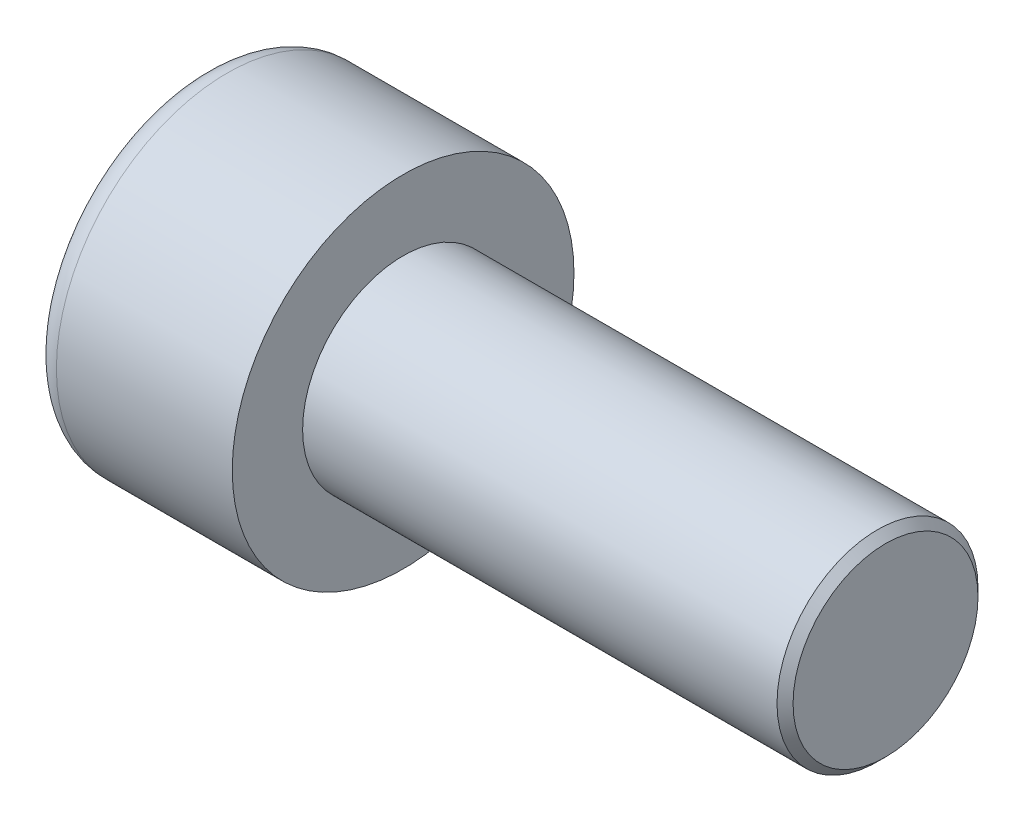
ISO-10303-21;
HEADER;
FILE_DESCRIPTION(('STEP AP214'),'2;1');
FILE_NAME('part.step','',(''),(''),'','','');
FILE_SCHEMA(('AUTOMOTIVE_DESIGN { 1 0 10303 214 1 1 1 1 }'));
ENDSEC;
DATA;
#1=APPLICATION_CONTEXT('core data for automotive mechanical design processes');
#2=APPLICATION_PROTOCOL_DEFINITION('international standard','automotive_design',2000,#1);
#3=PRODUCT_CONTEXT('',#1,'mechanical');
#4=PRODUCT('Part','Part','',(#3));
#5=PRODUCT_RELATED_PRODUCT_CATEGORY('part','',(#4));
#6=PRODUCT_DEFINITION_FORMATION('','',#4);
#7=PRODUCT_DEFINITION_CONTEXT('part definition',#1,'design');
#8=PRODUCT_DEFINITION('design','',#6,#7);
#9=PRODUCT_DEFINITION_SHAPE('','',#8);
#10=(LENGTH_UNIT() NAMED_UNIT(*) SI_UNIT(.MILLI.,.METRE.));
#11=(NAMED_UNIT(*) PLANE_ANGLE_UNIT() SI_UNIT($,.RADIAN.));
#12=(NAMED_UNIT(*) SI_UNIT($,.STERADIAN.) SOLID_ANGLE_UNIT());
#13=UNCERTAINTY_MEASURE_WITH_UNIT(LENGTH_MEASURE(1.E-05),#10,'distance_accuracy_value','');
#14=(GEOMETRIC_REPRESENTATION_CONTEXT(3) GLOBAL_UNCERTAINTY_ASSIGNED_CONTEXT((#13)) GLOBAL_UNIT_ASSIGNED_CONTEXT((#10,
#11,#12)) REPRESENTATION_CONTEXT('',''));
#15=CARTESIAN_POINT('',(0.,0.,0.));
#16=DIRECTION('',(0.,0.,1.));
#17=DIRECTION('',(1.,0.,0.));
#18=AXIS2_PLACEMENT_3D('',#15,#16,#17);
#19=CARTESIAN_POINT('',(2.5,0.,-2.3094010767585));
#20=DIRECTION('',(1.,0.,0.));
#21=DIRECTION('',(0.,0.,-1.));
#22=AXIS2_PLACEMENT_3D('',#19,#20,#21);
#23=PLANE('',#22);
#24=CARTESIAN_POINT('',(2.5,0.,0.));
#25=DIRECTION('',(1.,0.,0.));
#26=DIRECTION('',(0.,0.,-1.));
#27=AXIS2_PLACEMENT_3D('',#24,#25,#26);
#28=CIRCLE('',#27,2.);
#29=CARTESIAN_POINT('',(2.5,-1.,-1.73205080756888));
#30=VERTEX_POINT('',#29);
#31=CARTESIAN_POINT('',(2.5,-2.,0.));
#32=VERTEX_POINT('',#31);
#33=EDGE_CURVE('E160',#30,#32,#28,.F.);
#34=ORIENTED_EDGE('',*,*,#33,.F.);
#35=DIRECTION('',(0.,0.866025403784439,-0.5));
#36=VECTOR('',#35,1.);
#37=CARTESIAN_POINT('',(2.5,-2.,-1.15470053837925));
#38=LINE('',#37,#36);
#39=CARTESIAN_POINT('',(2.5,-2.,-1.15470053837925));
#40=VERTEX_POINT('',#39);
#41=EDGE_CURVE('E168',#40,#30,#38,.T.);
#42=ORIENTED_EDGE('',*,*,#41,.F.);
#43=DIRECTION('',(0.,0.,-1.));
#44=VECTOR('',#43,1.);
#45=CARTESIAN_POINT('',(2.5,-2.,1.15470053837925));
#46=LINE('',#45,#44);
#47=EDGE_CURVE('E185',#32,#40,#46,.T.);
#48=ORIENTED_EDGE('',*,*,#47,.F.);
#49=EDGE_LOOP('',(#34,#42,#48));
#50=FACE_BOUND('',#49,.T.);
#51=ADVANCED_FACE('F37',(#50),#23,.F.);
#52=CARTESIAN_POINT('',(2.5,-1.,1.73205080756888));
#53=VERTEX_POINT('',#52);
#54=EDGE_CURVE('E290',#32,#53,#28,.F.);
#55=ORIENTED_EDGE('',*,*,#54,.F.);
#56=CARTESIAN_POINT('',(2.5,-2.,1.15470053837925));
#57=VERTEX_POINT('',#56);
#58=EDGE_CURVE('E186',#57,#32,#46,.T.);
#59=ORIENTED_EDGE('',*,*,#58,.F.);
#60=DIRECTION('',(0.,-0.866025403784439,-0.5));
#61=VECTOR('',#60,1.);
#62=CARTESIAN_POINT('',(2.5,0.,2.3094010767585));
#63=LINE('',#62,#61);
#64=EDGE_CURVE('E181',#53,#57,#63,.T.);
#65=ORIENTED_EDGE('',*,*,#64,.F.);
#66=EDGE_LOOP('',(#55,#59,#65));
#67=FACE_BOUND('',#66,.T.);
#68=ADVANCED_FACE('F126',(#67),#23,.F.);
#69=CARTESIAN_POINT('',(2.5,1.,1.73205080756888));
#70=VERTEX_POINT('',#69);
#71=EDGE_CURVE('E286',#53,#70,#28,.F.);
#72=ORIENTED_EDGE('',*,*,#71,.F.);
#73=CARTESIAN_POINT('',(2.5,0.,2.3094010767585));
#74=VERTEX_POINT('',#73);
#75=EDGE_CURVE('E182',#74,#53,#63,.T.);
#76=ORIENTED_EDGE('',*,*,#75,.F.);
#77=DIRECTION('',(0.,-0.866025403784438,0.5));
#78=VECTOR('',#77,1.);
#79=CARTESIAN_POINT('',(2.5,2.,1.15470053837925));
#80=LINE('',#79,#78);
#81=EDGE_CURVE('E177',#70,#74,#80,.T.);
#82=ORIENTED_EDGE('',*,*,#81,.F.);
#83=EDGE_LOOP('',(#72,#76,#82));
#84=FACE_BOUND('',#83,.T.);
#85=ADVANCED_FACE('F132',(#84),#23,.F.);
#86=CARTESIAN_POINT('',(2.5,2.,0.));
#87=VERTEX_POINT('',#86);
#88=EDGE_CURVE('E157',#70,#87,#28,.F.);
#89=ORIENTED_EDGE('',*,*,#88,.F.);
#90=CARTESIAN_POINT('',(2.5,2.,1.15470053837925));
#91=VERTEX_POINT('',#90);
#92=EDGE_CURVE('E178',#91,#70,#80,.T.);
#93=ORIENTED_EDGE('',*,*,#92,.F.);
#94=DIRECTION('',(0.,0.,1.));
#95=VECTOR('',#94,1.);
#96=CARTESIAN_POINT('',(2.5,2.,-1.15470053837925));
#97=LINE('',#96,#95);
#98=EDGE_CURVE('E172',#87,#91,#97,.T.);
#99=ORIENTED_EDGE('',*,*,#98,.F.);
#100=EDGE_LOOP('',(#89,#93,#99));
#101=FACE_BOUND('',#100,.T.);
#102=ADVANCED_FACE('F146',(#101),#23,.F.);
#103=CARTESIAN_POINT('',(2.5,0.,0.));
#104=DIRECTION('',(1.,0.,0.));
#105=DIRECTION('',(0.,0.,-1.));
#106=AXIS2_PLACEMENT_3D('',#103,#104,#105);
#107=CIRCLE('',#106,2.);
#108=CARTESIAN_POINT('',(2.5,1.,-1.73205080756888));
#109=VERTEX_POINT('',#108);
#110=EDGE_CURVE('E52',#109,#87,#107,.T.);
#111=ORIENTED_EDGE('',*,*,#110,.T.);
#112=CARTESIAN_POINT('',(2.5,2.,-1.15470053837925));
#113=VERTEX_POINT('',#112);
#114=EDGE_CURVE('E165',#113,#87,#97,.T.);
#115=ORIENTED_EDGE('',*,*,#114,.F.);
#116=DIRECTION('',(0.,0.866025403784438,0.5));
#117=VECTOR('',#116,1.);
#118=CARTESIAN_POINT('',(2.5,0.,-2.3094010767585));
#119=LINE('',#118,#117);
#120=EDGE_CURVE('E162',#109,#113,#119,.T.);
#121=ORIENTED_EDGE('',*,*,#120,.F.);
#122=EDGE_LOOP('',(#111,#115,#121));
#123=FACE_BOUND('',#122,.T.);
#124=ADVANCED_FACE('F137',(#123),#23,.F.);
#125=EDGE_CURVE('E150',#109,#30,#28,.F.);
#126=ORIENTED_EDGE('',*,*,#125,.F.);
#127=CARTESIAN_POINT('',(2.5,0.,-2.3094010767585));
#128=VERTEX_POINT('',#127);
#129=EDGE_CURVE('E153',#128,#109,#119,.T.);
#130=ORIENTED_EDGE('',*,*,#129,.F.);
#131=EDGE_CURVE('E155',#30,#128,#38,.T.);
#132=ORIENTED_EDGE('',*,*,#131,.F.);
#133=EDGE_LOOP('',(#126,#130,#132));
#134=FACE_BOUND('',#133,.T.);
#135=ADVANCED_FACE('F128',(#134),#23,.F.);
#136=CARTESIAN_POINT('',(0.,0.,0.));
#137=DIRECTION('',(1.,0.,0.));
#138=DIRECTION('',(0.,0.,-1.));
#139=AXIS2_PLACEMENT_3D('',#136,#137,#138);
#140=PLANE('',#139);
#141=CARTESIAN_POINT('',(0.,0.,0.));
#142=DIRECTION('',(1.,0.,0.));
#143=DIRECTION('',(0.,0.,-1.));
#144=AXIS2_PLACEMENT_3D('',#141,#142,#143);
#145=CIRCLE('',#144,3.625);
#146=CARTESIAN_POINT('',(0.,0.,-3.625));
#147=VERTEX_POINT('',#146);
#148=EDGE_CURVE('E225',#147,#147,#145,.F.);
#149=ORIENTED_EDGE('',*,*,#148,.T.);
#150=EDGE_LOOP('',(#149));
#151=FACE_BOUND('',#150,.T.);
#152=DIRECTION('',(0.,0.866025403784439,-0.5));
#153=VECTOR('',#152,1.);
#154=CARTESIAN_POINT('',(0.,-2.,-1.15470053837925));
#155=LINE('',#154,#153);
#156=CARTESIAN_POINT('',(0.,-2.,-1.15470053837925));
#157=VERTEX_POINT('',#156);
#158=CARTESIAN_POINT('',(0.,0.,-2.3094010767585));
#159=VERTEX_POINT('',#158);
#160=EDGE_CURVE('E60',#157,#159,#155,.T.);
#161=ORIENTED_EDGE('',*,*,#160,.T.);
#162=DIRECTION('',(0.,0.866025403784438,0.5));
#163=VECTOR('',#162,1.);
#164=CARTESIAN_POINT('',(0.,0.,-2.3094010767585));
#165=LINE('',#164,#163);
#166=CARTESIAN_POINT('',(0.,2.,-1.15470053837925));
#167=VERTEX_POINT('',#166);
#168=EDGE_CURVE('E191',#159,#167,#165,.T.);
#169=ORIENTED_EDGE('',*,*,#168,.T.);
#170=DIRECTION('',(0.,0.,1.));
#171=VECTOR('',#170,1.);
#172=CARTESIAN_POINT('',(0.,2.,-1.15470053837925));
#173=LINE('',#172,#171);
#174=CARTESIAN_POINT('',(0.,2.,1.15470053837925));
#175=VERTEX_POINT('',#174);
#176=EDGE_CURVE('E194',#167,#175,#173,.T.);
#177=ORIENTED_EDGE('',*,*,#176,.T.);
#178=DIRECTION('',(0.,-0.866025403784438,0.5));
#179=VECTOR('',#178,1.);
#180=CARTESIAN_POINT('',(0.,2.,1.15470053837925));
#181=LINE('',#180,#179);
#182=CARTESIAN_POINT('',(0.,0.,2.3094010767585));
#183=VERTEX_POINT('',#182);
#184=EDGE_CURVE('E197',#175,#183,#181,.T.);
#185=ORIENTED_EDGE('',*,*,#184,.T.);
#186=DIRECTION('',(0.,-0.866025403784439,-0.5));
#187=VECTOR('',#186,1.);
#188=CARTESIAN_POINT('',(0.,0.,2.3094010767585));
#189=LINE('',#188,#187);
#190=CARTESIAN_POINT('',(0.,-2.,1.15470053837925));
#191=VERTEX_POINT('',#190);
#192=EDGE_CURVE('E200',#183,#191,#189,.T.);
#193=ORIENTED_EDGE('',*,*,#192,.T.);
#194=DIRECTION('',(0.,0.,-1.));
#195=VECTOR('',#194,1.);
#196=CARTESIAN_POINT('',(0.,-2.,1.15470053837925));
#197=LINE('',#196,#195);
#198=EDGE_CURVE('E203',#191,#157,#197,.T.);
#199=ORIENTED_EDGE('',*,*,#198,.T.);
#200=EDGE_LOOP('',(#161,#169,#177,#185,#193,#199));
#201=FACE_BOUND('',#200,.T.);
#202=ADVANCED_FACE('F136',(#151,#201),#140,.F.);
#203=CARTESIAN_POINT('',(5.,0.,0.));
#204=DIRECTION('',(1.,0.,0.));
#205=DIRECTION('',(0.,0.,-1.));
#206=AXIS2_PLACEMENT_3D('',#203,#204,#205);
#207=PLANE('',#206);
#208=CARTESIAN_POINT('',(5.,0.,0.));
#209=DIRECTION('',(1.,0.,0.));
#210=DIRECTION('',(0.,0.,-1.));
#211=AXIS2_PLACEMENT_3D('',#208,#209,#210);
#212=CIRCLE('',#211,4.25);
#213=CARTESIAN_POINT('',(5.,0.,-4.25));
#214=VERTEX_POINT('',#213);
#215=EDGE_CURVE('E158',#214,#214,#212,.T.);
#216=ORIENTED_EDGE('',*,*,#215,.T.);
#217=EDGE_LOOP('',(#216));
#218=FACE_BOUND('',#217,.T.);
#219=CARTESIAN_POINT('',(5.,0.,0.));
#220=DIRECTION('',(1.,0.,0.));
#221=DIRECTION('',(0.,0.,-1.));
#222=AXIS2_PLACEMENT_3D('',#219,#220,#221);
#223=CIRCLE('',#222,2.5);
#224=CARTESIAN_POINT('',(5.,0.,-2.5));
#225=VERTEX_POINT('',#224);
#226=EDGE_CURVE('E216',#225,#225,#223,.T.);
#227=ORIENTED_EDGE('',*,*,#226,.F.);
#228=EDGE_LOOP('',(#227));
#229=FACE_BOUND('',#228,.T.);
#230=ADVANCED_FACE('F143',(#218,#229),#207,.T.);
#231=CARTESIAN_POINT('',(5.,0.,0.));
#232=DIRECTION('',(-1.,0.,0.));
#233=DIRECTION('',(0.,0.,1.));
#234=AXIS2_PLACEMENT_3D('',#231,#232,#233);
#235=CYLINDRICAL_SURFACE('',#234,4.25);
#236=CARTESIAN_POINT('',(0.625,0.,0.));
#237=DIRECTION('',(1.,0.,0.));
#238=DIRECTION('',(0.,0.,-1.));
#239=AXIS2_PLACEMENT_3D('',#236,#237,#238);
#240=CIRCLE('',#239,4.25);
#241=CARTESIAN_POINT('',(0.625,0.,-4.25));
#242=VERTEX_POINT('',#241);
#243=EDGE_CURVE('E222',#242,#242,#240,.T.);
#244=ORIENTED_EDGE('',*,*,#243,.T.);
#245=EDGE_LOOP('',(#244));
#246=FACE_BOUND('',#245,.T.);
#247=ORIENTED_EDGE('',*,*,#215,.F.);
#248=EDGE_LOOP('',(#247));
#249=FACE_BOUND('',#248,.T.);
#250=ADVANCED_FACE('F241',(#246,#249),#235,.T.);
#251=CARTESIAN_POINT('',(17.,0.,0.));
#252=DIRECTION('',(-1.,0.,0.));
#253=DIRECTION('',(0.,0.,1.));
#254=AXIS2_PLACEMENT_3D('',#251,#252,#253);
#255=CYLINDRICAL_SURFACE('',#254,2.5);
#256=CARTESIAN_POINT('',(16.8,0.,0.));
#257=DIRECTION('',(1.,0.,0.));
#258=DIRECTION('',(0.,0.,-1.));
#259=AXIS2_PLACEMENT_3D('',#256,#257,#258);
#260=CIRCLE('',#259,2.5);
#261=CARTESIAN_POINT('',(16.8,0.,-2.5));
#262=VERTEX_POINT('',#261);
#263=EDGE_CURVE('E11',#262,#262,#260,.F.);
#264=ORIENTED_EDGE('',*,*,#263,.T.);
#265=EDGE_LOOP('',(#264));
#266=FACE_BOUND('',#265,.T.);
#267=ORIENTED_EDGE('',*,*,#226,.T.);
#268=EDGE_LOOP('',(#267));
#269=FACE_BOUND('',#268,.T.);
#270=ADVANCED_FACE('F238',(#266,#269),#255,.T.);
#271=CARTESIAN_POINT('',(17.,0.,0.));
#272=DIRECTION('',(1.,0.,0.));
#273=DIRECTION('',(0.,0.,-1.));
#274=AXIS2_PLACEMENT_3D('',#271,#272,#273);
#275=PLANE('',#274);
#276=CARTESIAN_POINT('',(17.,0.,0.));
#277=DIRECTION('',(1.,0.,0.));
#278=DIRECTION('',(0.,0.,-1.));
#279=AXIS2_PLACEMENT_3D('',#276,#277,#278);
#280=CIRCLE('',#279,2.3);
#281=CARTESIAN_POINT('',(17.,0.,-2.3));
#282=VERTEX_POINT('',#281);
#283=EDGE_CURVE('E45',#282,#282,#280,.T.);
#284=ORIENTED_EDGE('',*,*,#283,.T.);
#285=EDGE_LOOP('',(#284));
#286=FACE_BOUND('',#285,.T.);
#287=ADVANCED_FACE('F230',(#286),#275,.T.);
#288=CARTESIAN_POINT('',(2.5,-2.,-1.15470053837925));
#289=DIRECTION('',(0.,0.5,0.866025403784438));
#290=DIRECTION('',(0.,-0.866025403784439,0.5));
#291=AXIS2_PLACEMENT_3D('',#288,#289,#290);
#292=PLANE('',#291);
#293=ORIENTED_EDGE('',*,*,#160,.F.);
#294=DIRECTION('',(-1.,0.,0.));
#295=VECTOR('',#294,1.);
#296=CARTESIAN_POINT('',(2.5,-2.,-1.15470053837925));
#297=LINE('',#296,#295);
#298=EDGE_CURVE('E189',#40,#157,#297,.T.);
#299=ORIENTED_EDGE('',*,*,#298,.F.);
#300=ORIENTED_EDGE('',*,*,#41,.T.);
#301=ORIENTED_EDGE('',*,*,#131,.T.);
#302=DIRECTION('',(-1.,0.,0.));
#303=VECTOR('',#302,1.);
#304=CARTESIAN_POINT('',(2.5,0.,-2.3094010767585));
#305=LINE('',#304,#303);
#306=EDGE_CURVE('E171',#128,#159,#305,.T.);
#307=ORIENTED_EDGE('',*,*,#306,.T.);
#308=EDGE_LOOP('',(#293,#299,#300,#301,#307));
#309=FACE_BOUND('',#308,.T.);
#310=ADVANCED_FACE('F256',(#309),#292,.T.);
#311=CARTESIAN_POINT('',(2.5,0.,-2.3094010767585));
#312=DIRECTION('',(0.,-0.5,0.866025403784438));
#313=DIRECTION('',(0.,-0.866025403784438,-0.5));
#314=AXIS2_PLACEMENT_3D('',#311,#312,#313);
#315=PLANE('',#314);
#316=ORIENTED_EDGE('',*,*,#168,.F.);
#317=ORIENTED_EDGE('',*,*,#306,.F.);
#318=ORIENTED_EDGE('',*,*,#129,.T.);
#319=ORIENTED_EDGE('',*,*,#120,.T.);
#320=DIRECTION('',(-1.,0.,0.));
#321=VECTOR('',#320,1.);
#322=CARTESIAN_POINT('',(2.5,2.,-1.15470053837925));
#323=LINE('',#322,#321);
#324=EDGE_CURVE('E213',#113,#167,#323,.T.);
#325=ORIENTED_EDGE('',*,*,#324,.T.);
#326=EDGE_LOOP('',(#316,#317,#318,#319,#325));
#327=FACE_BOUND('',#326,.T.);
#328=ADVANCED_FACE('F170',(#327),#315,.T.);
#329=CARTESIAN_POINT('',(2.5,2.,-1.15470053837925));
#330=DIRECTION('',(0.,-1.,0.));
#331=DIRECTION('',(0.,0.,-1.));
#332=AXIS2_PLACEMENT_3D('',#329,#330,#331);
#333=PLANE('',#332);
#334=ORIENTED_EDGE('',*,*,#176,.F.);
#335=ORIENTED_EDGE('',*,*,#324,.F.);
#336=ORIENTED_EDGE('',*,*,#114,.T.);
#337=ORIENTED_EDGE('',*,*,#98,.T.);
#338=DIRECTION('',(-1.,0.,0.));
#339=VECTOR('',#338,1.);
#340=CARTESIAN_POINT('',(2.5,2.,1.15470053837925));
#341=LINE('',#340,#339);
#342=EDGE_CURVE('E211',#91,#175,#341,.T.);
#343=ORIENTED_EDGE('',*,*,#342,.T.);
#344=EDGE_LOOP('',(#334,#335,#336,#337,#343));
#345=FACE_BOUND('',#344,.T.);
#346=ADVANCED_FACE('F261',(#345),#333,.T.);
#347=CARTESIAN_POINT('',(2.5,2.,1.15470053837925));
#348=DIRECTION('',(0.,-0.5,-0.866025403784439));
#349=DIRECTION('',(0.,0.866025403784439,-0.5));
#350=AXIS2_PLACEMENT_3D('',#347,#348,#349);
#351=PLANE('',#350);
#352=ORIENTED_EDGE('',*,*,#184,.F.);
#353=ORIENTED_EDGE('',*,*,#342,.F.);
#354=ORIENTED_EDGE('',*,*,#92,.T.);
#355=ORIENTED_EDGE('',*,*,#81,.T.);
#356=DIRECTION('',(-1.,0.,0.));
#357=VECTOR('',#356,1.);
#358=CARTESIAN_POINT('',(2.5,0.,2.3094010767585));
#359=LINE('',#358,#357);
#360=EDGE_CURVE('E209',#74,#183,#359,.T.);
#361=ORIENTED_EDGE('',*,*,#360,.T.);
#362=EDGE_LOOP('',(#352,#353,#354,#355,#361));
#363=FACE_BOUND('',#362,.T.);
#364=ADVANCED_FACE('F264',(#363),#351,.T.);
#365=CARTESIAN_POINT('',(2.5,0.,2.3094010767585));
#366=DIRECTION('',(0.,0.5,-0.866025403784439));
#367=DIRECTION('',(0.,0.866025403784439,0.5));
#368=AXIS2_PLACEMENT_3D('',#365,#366,#367);
#369=PLANE('',#368);
#370=ORIENTED_EDGE('',*,*,#192,.F.);
#371=ORIENTED_EDGE('',*,*,#360,.F.);
#372=ORIENTED_EDGE('',*,*,#75,.T.);
#373=ORIENTED_EDGE('',*,*,#64,.T.);
#374=DIRECTION('',(-1.,0.,0.));
#375=VECTOR('',#374,1.);
#376=CARTESIAN_POINT('',(2.5,-2.,1.15470053837925));
#377=LINE('',#376,#375);
#378=EDGE_CURVE('E207',#57,#191,#377,.T.);
#379=ORIENTED_EDGE('',*,*,#378,.T.);
#380=EDGE_LOOP('',(#370,#371,#372,#373,#379));
#381=FACE_BOUND('',#380,.T.);
#382=ADVANCED_FACE('F121',(#381),#369,.T.);
#383=CARTESIAN_POINT('',(2.5,-2.,1.15470053837925));
#384=DIRECTION('',(0.,1.,0.));
#385=DIRECTION('',(0.,0.,1.));
#386=AXIS2_PLACEMENT_3D('',#383,#384,#385);
#387=PLANE('',#386);
#388=ORIENTED_EDGE('',*,*,#198,.F.);
#389=ORIENTED_EDGE('',*,*,#378,.F.);
#390=ORIENTED_EDGE('',*,*,#58,.T.);
#391=ORIENTED_EDGE('',*,*,#47,.T.);
#392=ORIENTED_EDGE('',*,*,#298,.T.);
#393=EDGE_LOOP('',(#388,#389,#390,#391,#392));
#394=FACE_BOUND('',#393,.T.);
#395=ADVANCED_FACE('F114',(#394),#387,.T.);
#396=CARTESIAN_POINT('',(2.5,0.,0.));
#397=DIRECTION('',(-1.,0.,0.));
#398=DIRECTION('',(0.,0.,1.));
#399=AXIS2_PLACEMENT_3D('',#396,#397,#398);
#400=CONICAL_SURFACE('',#399,2.,1.04719755119659);
#401=CARTESIAN_POINT('',(3.65470053837926,0.,0.));
#402=VERTEX_POINT('',#401);
#403=VERTEX_LOOP('',#402);
#404=FACE_BOUND('',#403,.T.);
#405=ORIENTED_EDGE('',*,*,#110,.F.);
#406=ORIENTED_EDGE('',*,*,#125,.T.);
#407=ORIENTED_EDGE('',*,*,#33,.T.);
#408=ORIENTED_EDGE('',*,*,#54,.T.);
#409=ORIENTED_EDGE('',*,*,#71,.T.);
#410=ORIENTED_EDGE('',*,*,#88,.T.);
#411=EDGE_LOOP('',(#405,#406,#407,#408,#409,#410));
#412=FACE_BOUND('',#411,.T.);
#413=ADVANCED_FACE('F111',(#404,#412),#400,.F.);
#414=CARTESIAN_POINT('',(0.625,0.,0.));
#415=DIRECTION('',(1.,0.,0.));
#416=DIRECTION('',(0.,0.,-1.));
#417=AXIS2_PLACEMENT_3D('',#414,#415,#416);
#418=TOROIDAL_SURFACE('',#417,3.625,0.625);
#419=ORIENTED_EDGE('',*,*,#148,.F.);
#420=EDGE_LOOP('',(#419));
#421=FACE_BOUND('',#420,.T.);
#422=ORIENTED_EDGE('',*,*,#243,.F.);
#423=EDGE_LOOP('',(#422));
#424=FACE_BOUND('',#423,.T.);
#425=ADVANCED_FACE('F113',(#421,#424),#418,.T.);
#426=CARTESIAN_POINT('',(17.,0.,0.));
#427=DIRECTION('',(-1.,0.,0.));
#428=DIRECTION('',(0.,0.,1.));
#429=AXIS2_PLACEMENT_3D('',#426,#427,#428);
#430=CONICAL_SURFACE('',#429,2.3,0.785398163397451);
#431=ORIENTED_EDGE('',*,*,#263,.F.);
#432=EDGE_LOOP('',(#431));
#433=FACE_BOUND('',#432,.T.);
#434=ORIENTED_EDGE('',*,*,#283,.F.);
#435=EDGE_LOOP('',(#434));
#436=FACE_BOUND('',#435,.T.);
#437=ADVANCED_FACE('F39',(#433,#436),#430,.T.);
#438=CLOSED_SHELL('',(#51,#68,#85,#102,#124,#135,#202,#230,#250,#270,#287,#310,#328,#346,#364,
#382,#395,#413,#425,#437));
#439=MANIFOLD_SOLID_BREP('B2',#438);
#440=ADVANCED_BREP_SHAPE_REPRESENTATION('',(#18,#439),#14);
#441=SHAPE_DEFINITION_REPRESENTATION(#9,#440);
ENDSEC;
END-ISO-10303-21;
